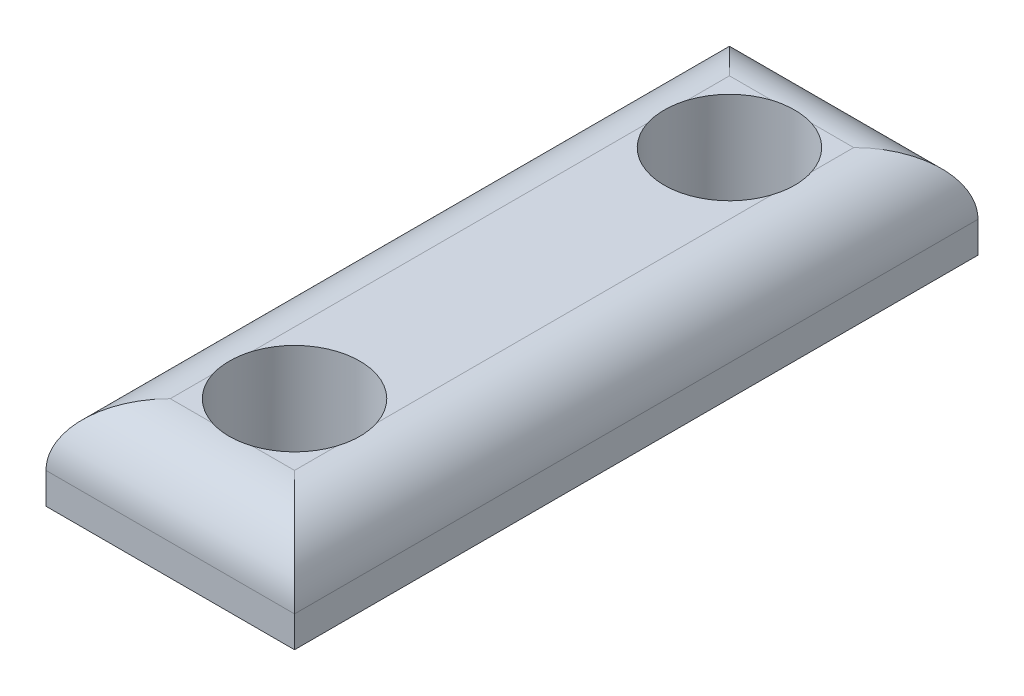
ISO-10303-21;
HEADER;
FILE_DESCRIPTION(('STEP AP214'),'2;1');
FILE_NAME('part.step','',(''),(''),'','','');
FILE_SCHEMA(('AUTOMOTIVE_DESIGN { 1 0 10303 214 1 1 1 1 }'));
ENDSEC;
DATA;
#1=APPLICATION_CONTEXT('core data for automotive mechanical design processes');
#2=APPLICATION_PROTOCOL_DEFINITION('international standard','automotive_design',2000,#1);
#3=PRODUCT_CONTEXT('',#1,'mechanical');
#4=PRODUCT('Part','Part','',(#3));
#5=PRODUCT_RELATED_PRODUCT_CATEGORY('part','',(#4));
#6=PRODUCT_DEFINITION_FORMATION('','',#4);
#7=PRODUCT_DEFINITION_CONTEXT('part definition',#1,'design');
#8=PRODUCT_DEFINITION('design','',#6,#7);
#9=PRODUCT_DEFINITION_SHAPE('','',#8);
#10=(LENGTH_UNIT() NAMED_UNIT(*) SI_UNIT(.MILLI.,.METRE.));
#11=(NAMED_UNIT(*) PLANE_ANGLE_UNIT() SI_UNIT($,.RADIAN.));
#12=(NAMED_UNIT(*) SI_UNIT($,.STERADIAN.) SOLID_ANGLE_UNIT());
#13=UNCERTAINTY_MEASURE_WITH_UNIT(LENGTH_MEASURE(1.E-05),#10,'distance_accuracy_value','');
#14=(GEOMETRIC_REPRESENTATION_CONTEXT(3) GLOBAL_UNCERTAINTY_ASSIGNED_CONTEXT((#13)) GLOBAL_UNIT_ASSIGNED_CONTEXT((#10,
#11,#12)) REPRESENTATION_CONTEXT('',''));
#15=CARTESIAN_POINT('',(0.,0.,0.));
#16=DIRECTION('',(0.,0.,1.));
#17=DIRECTION('',(1.,0.,0.));
#18=AXIS2_PLACEMENT_3D('',#15,#16,#17);
#19=CARTESIAN_POINT('',(0.,1.5,0.));
#20=DIRECTION('',(0.,-1.,0.));
#21=DIRECTION('',(0.,0.,-1.));
#22=AXIS2_PLACEMENT_3D('',#19,#20,#21);
#23=PLANE('',#22);
#24=CARTESIAN_POINT('',(2.,1.5,-2.));
#25=DIRECTION('',(0.,1.,0.));
#26=DIRECTION('',(0.,0.,1.));
#27=AXIS2_PLACEMENT_3D('',#24,#25,#26);
#28=CIRCLE('',#27,1.05);
#29=CARTESIAN_POINT('',(2.32015621187164,1.5,-1.));
#30=VERTEX_POINT('',#29);
#31=CARTESIAN_POINT('',(3.,1.5,-1.67984378812835));
#32=VERTEX_POINT('',#31);
#33=EDGE_CURVE('E307',#30,#32,#28,.T.);
#34=ORIENTED_EDGE('',*,*,#33,.F.);
#35=DIRECTION('',(1.,0.,0.));
#36=VECTOR('',#35,1.);
#37=CARTESIAN_POINT('',(0.,1.5,-1.));
#38=LINE('',#37,#36);
#39=CARTESIAN_POINT('',(3.,1.5,-1.));
#40=VERTEX_POINT('',#39);
#41=EDGE_CURVE('E211',#30,#40,#38,.T.);
#42=ORIENTED_EDGE('',*,*,#41,.T.);
#43=DIRECTION('',(0.,0.,-1.));
#44=VECTOR('',#43,1.);
#45=CARTESIAN_POINT('',(3.,1.5,0.));
#46=LINE('',#45,#44);
#47=EDGE_CURVE('E208',#40,#32,#46,.T.);
#48=ORIENTED_EDGE('',*,*,#47,.T.);
#49=EDGE_LOOP('',(#34,#42,#48));
#50=FACE_BOUND('',#49,.T.);
#51=ADVANCED_FACE('F45',(#50),#23,.F.);
#52=CARTESIAN_POINT('',(3.,1.5,-2.32015621187165));
#53=VERTEX_POINT('',#52);
#54=CARTESIAN_POINT('',(1.,1.5,-2.32015621187164));
#55=VERTEX_POINT('',#54);
#56=EDGE_CURVE('E306',#53,#55,#28,.T.);
#57=ORIENTED_EDGE('',*,*,#56,.F.);
#58=DIRECTION('',(0.,0.,-1.));
#59=VECTOR('',#58,1.);
#60=CARTESIAN_POINT('',(3.,1.5,0.));
#61=LINE('',#60,#59);
#62=CARTESIAN_POINT('',(3.,1.5,-8.67984378812836));
#63=VERTEX_POINT('',#62);
#64=EDGE_CURVE('E205',#53,#63,#61,.T.);
#65=ORIENTED_EDGE('',*,*,#64,.T.);
#66=CARTESIAN_POINT('',(2.,1.5,-9.));
#67=DIRECTION('',(0.,1.,0.));
#68=DIRECTION('',(0.,0.,1.));
#69=AXIS2_PLACEMENT_3D('',#66,#67,#68);
#70=CIRCLE('',#69,1.05);
#71=CARTESIAN_POINT('',(1.,1.5,-8.67984378812836));
#72=VERTEX_POINT('',#71);
#73=EDGE_CURVE('E315',#72,#63,#70,.T.);
#74=ORIENTED_EDGE('',*,*,#73,.F.);
#75=DIRECTION('',(0.,0.,1.));
#76=VECTOR('',#75,1.);
#77=CARTESIAN_POINT('',(1.,1.5,0.));
#78=LINE('',#77,#76);
#79=EDGE_CURVE('E190',#72,#55,#78,.T.);
#80=ORIENTED_EDGE('',*,*,#79,.T.);
#81=EDGE_LOOP('',(#57,#65,#74,#80));
#82=FACE_BOUND('',#81,.T.);
#83=ADVANCED_FACE('F350',(#82),#23,.F.);
#84=CARTESIAN_POINT('',(3.,1.5,-9.32015621187164));
#85=VERTEX_POINT('',#84);
#86=CARTESIAN_POINT('',(2.32015621187165,1.5,-10.));
#87=VERTEX_POINT('',#86);
#88=EDGE_CURVE('E166',#85,#87,#70,.T.);
#89=ORIENTED_EDGE('',*,*,#88,.F.);
#90=DIRECTION('',(0.,0.,-1.));
#91=VECTOR('',#90,1.);
#92=CARTESIAN_POINT('',(3.,1.5,0.));
#93=LINE('',#92,#91);
#94=CARTESIAN_POINT('',(3.,1.5,-10.));
#95=VERTEX_POINT('',#94);
#96=EDGE_CURVE('E202',#85,#95,#93,.T.);
#97=ORIENTED_EDGE('',*,*,#96,.T.);
#98=DIRECTION('',(-1.,0.,0.));
#99=VECTOR('',#98,1.);
#100=CARTESIAN_POINT('',(0.,1.5,-10.));
#101=LINE('',#100,#99);
#102=EDGE_CURVE('E199',#95,#87,#101,.T.);
#103=ORIENTED_EDGE('',*,*,#102,.T.);
#104=EDGE_LOOP('',(#89,#97,#103));
#105=FACE_BOUND('',#104,.T.);
#106=ADVANCED_FACE('F352',(#105),#23,.F.);
#107=CARTESIAN_POINT('',(1.67984378812835,1.5,-10.));
#108=VERTEX_POINT('',#107);
#109=CARTESIAN_POINT('',(1.,1.5,-9.32015621187164));
#110=VERTEX_POINT('',#109);
#111=EDGE_CURVE('E320',#108,#110,#70,.T.);
#112=ORIENTED_EDGE('',*,*,#111,.F.);
#113=DIRECTION('',(-1.,0.,0.));
#114=VECTOR('',#113,1.);
#115=CARTESIAN_POINT('',(0.,1.5,-10.));
#116=LINE('',#115,#114);
#117=CARTESIAN_POINT('',(1.,1.5,-10.));
#118=VERTEX_POINT('',#117);
#119=EDGE_CURVE('E196',#108,#118,#116,.T.);
#120=ORIENTED_EDGE('',*,*,#119,.T.);
#121=DIRECTION('',(0.,0.,1.));
#122=VECTOR('',#121,1.);
#123=CARTESIAN_POINT('',(1.,1.5,0.));
#124=LINE('',#123,#122);
#125=EDGE_CURVE('E193',#118,#110,#124,.T.);
#126=ORIENTED_EDGE('',*,*,#125,.T.);
#127=EDGE_LOOP('',(#112,#120,#126));
#128=FACE_BOUND('',#127,.T.);
#129=ADVANCED_FACE('F354',(#128),#23,.F.);
#130=CARTESIAN_POINT('',(0.,1.5,0.));
#131=DIRECTION('',(1.,0.,0.));
#132=DIRECTION('',(0.,0.,-1.));
#133=AXIS2_PLACEMENT_3D('',#130,#131,#132);
#134=PLANE('',#133);
#135=DIRECTION('',(0.,-1.,0.));
#136=VECTOR('',#135,1.);
#137=CARTESIAN_POINT('',(0.,1.5,0.));
#138=LINE('',#137,#136);
#139=CARTESIAN_POINT('',(0.,0.5,0.));
#140=VERTEX_POINT('',#139);
#141=CARTESIAN_POINT('',(0.,0.,0.));
#142=VERTEX_POINT('',#141);
#143=EDGE_CURVE('E136',#140,#142,#138,.T.);
#144=ORIENTED_EDGE('',*,*,#143,.F.);
#145=DIRECTION('',(0.,0.,1.));
#146=VECTOR('',#145,1.);
#147=CARTESIAN_POINT('',(0.,0.5,0.));
#148=LINE('',#147,#146);
#149=CARTESIAN_POINT('',(0.,0.5,-11.));
#150=VERTEX_POINT('',#149);
#151=EDGE_CURVE('E11',#140,#150,#148,.F.);
#152=ORIENTED_EDGE('',*,*,#151,.T.);
#153=DIRECTION('',(0.,-1.,0.));
#154=VECTOR('',#153,1.);
#155=CARTESIAN_POINT('',(0.,1.5,-11.));
#156=LINE('',#155,#154);
#157=CARTESIAN_POINT('',(0.,0.,-11.));
#158=VERTEX_POINT('',#157);
#159=EDGE_CURVE('E159',#150,#158,#156,.T.);
#160=ORIENTED_EDGE('',*,*,#159,.T.);
#161=DIRECTION('',(0.,0.,1.));
#162=VECTOR('',#161,1.);
#163=CARTESIAN_POINT('',(0.,0.,0.));
#164=LINE('',#163,#162);
#165=EDGE_CURVE('E153',#158,#142,#164,.T.);
#166=ORIENTED_EDGE('',*,*,#165,.T.);
#167=EDGE_LOOP('',(#144,#152,#160,#166));
#168=FACE_BOUND('',#167,.T.);
#169=ADVANCED_FACE('F158',(#168),#134,.F.);
#170=CARTESIAN_POINT('',(0.,1.5,0.));
#171=DIRECTION('',(0.,0.,-1.));
#172=DIRECTION('',(-1.,0.,0.));
#173=AXIS2_PLACEMENT_3D('',#170,#171,#172);
#174=PLANE('',#173);
#175=DIRECTION('',(0.,-1.,0.));
#176=VECTOR('',#175,1.);
#177=CARTESIAN_POINT('',(4.,1.5,0.));
#178=LINE('',#177,#176);
#179=CARTESIAN_POINT('',(4.,0.5,0.));
#180=VERTEX_POINT('',#179);
#181=CARTESIAN_POINT('',(4.,0.,0.));
#182=VERTEX_POINT('',#181);
#183=EDGE_CURVE('E147',#180,#182,#178,.T.);
#184=ORIENTED_EDGE('',*,*,#183,.F.);
#185=DIRECTION('',(1.,0.,0.));
#186=VECTOR('',#185,1.);
#187=CARTESIAN_POINT('',(0.,0.5,0.));
#188=LINE('',#187,#186);
#189=EDGE_CURVE('E143',#180,#140,#188,.F.);
#190=ORIENTED_EDGE('',*,*,#189,.T.);
#191=ORIENTED_EDGE('',*,*,#143,.T.);
#192=DIRECTION('',(1.,0.,0.));
#193=VECTOR('',#192,1.);
#194=CARTESIAN_POINT('',(0.,0.,0.));
#195=LINE('',#194,#193);
#196=EDGE_CURVE('E140',#142,#182,#195,.T.);
#197=ORIENTED_EDGE('',*,*,#196,.T.);
#198=EDGE_LOOP('',(#184,#190,#191,#197));
#199=FACE_BOUND('',#198,.T.);
#200=ADVANCED_FACE('F139',(#199),#174,.F.);
#201=CARTESIAN_POINT('',(4.,1.5,0.));
#202=DIRECTION('',(-1.,0.,0.));
#203=DIRECTION('',(0.,0.,1.));
#204=AXIS2_PLACEMENT_3D('',#201,#202,#203);
#205=PLANE('',#204);
#206=DIRECTION('',(0.,-1.,0.));
#207=VECTOR('',#206,1.);
#208=CARTESIAN_POINT('',(4.,1.5,-11.));
#209=LINE('',#208,#207);
#210=CARTESIAN_POINT('',(4.,0.5,-11.));
#211=VERTEX_POINT('',#210);
#212=CARTESIAN_POINT('',(4.,0.,-11.));
#213=VERTEX_POINT('',#212);
#214=EDGE_CURVE('E179',#211,#213,#209,.T.);
#215=ORIENTED_EDGE('',*,*,#214,.F.);
#216=DIRECTION('',(0.,0.,-1.));
#217=VECTOR('',#216,1.);
#218=CARTESIAN_POINT('',(4.,0.5,0.));
#219=LINE('',#218,#217);
#220=EDGE_CURVE('E272',#211,#180,#219,.F.);
#221=ORIENTED_EDGE('',*,*,#220,.T.);
#222=ORIENTED_EDGE('',*,*,#183,.T.);
#223=DIRECTION('',(0.,0.,-1.));
#224=VECTOR('',#223,1.);
#225=CARTESIAN_POINT('',(4.,0.,0.));
#226=LINE('',#225,#224);
#227=EDGE_CURVE('E155',#182,#213,#226,.T.);
#228=ORIENTED_EDGE('',*,*,#227,.T.);
#229=EDGE_LOOP('',(#215,#221,#222,#228));
#230=FACE_BOUND('',#229,.T.);
#231=ADVANCED_FACE('F372',(#230),#205,.F.);
#232=CARTESIAN_POINT('',(0.,1.5,-11.));
#233=DIRECTION('',(0.,0.,1.));
#234=DIRECTION('',(1.,0.,0.));
#235=AXIS2_PLACEMENT_3D('',#232,#233,#234);
#236=PLANE('',#235);
#237=ORIENTED_EDGE('',*,*,#159,.F.);
#238=DIRECTION('',(-1.,0.,0.));
#239=VECTOR('',#238,1.);
#240=CARTESIAN_POINT('',(0.,0.5,-11.));
#241=LINE('',#240,#239);
#242=EDGE_CURVE('E56',#150,#211,#241,.F.);
#243=ORIENTED_EDGE('',*,*,#242,.T.);
#244=ORIENTED_EDGE('',*,*,#214,.T.);
#245=DIRECTION('',(-1.,0.,0.));
#246=VECTOR('',#245,1.);
#247=CARTESIAN_POINT('',(0.,0.,-11.));
#248=LINE('',#247,#246);
#249=EDGE_CURVE('E174',#213,#158,#248,.T.);
#250=ORIENTED_EDGE('',*,*,#249,.T.);
#251=EDGE_LOOP('',(#237,#243,#244,#250));
#252=FACE_BOUND('',#251,.T.);
#253=ADVANCED_FACE('F366',(#252),#236,.F.);
#254=DIRECTION('',(0.,0.,1.));
#255=VECTOR('',#254,1.);
#256=CARTESIAN_POINT('',(1.,1.5,0.));
#257=LINE('',#256,#255);
#258=CARTESIAN_POINT('',(1.,1.5,-1.67984378812836));
#259=VERTEX_POINT('',#258);
#260=CARTESIAN_POINT('',(1.,1.5,-1.));
#261=VERTEX_POINT('',#260);
#262=EDGE_CURVE('E146',#259,#261,#257,.T.);
#263=ORIENTED_EDGE('',*,*,#262,.T.);
#264=DIRECTION('',(1.,0.,0.));
#265=VECTOR('',#264,1.);
#266=CARTESIAN_POINT('',(0.,1.5,-1.));
#267=LINE('',#266,#265);
#268=CARTESIAN_POINT('',(1.67984378812836,1.5,-1.));
#269=VERTEX_POINT('',#268);
#270=EDGE_CURVE('E186',#261,#269,#267,.T.);
#271=ORIENTED_EDGE('',*,*,#270,.T.);
#272=EDGE_CURVE('E301',#259,#269,#28,.T.);
#273=ORIENTED_EDGE('',*,*,#272,.F.);
#274=EDGE_LOOP('',(#263,#271,#273));
#275=FACE_BOUND('',#274,.T.);
#276=ADVANCED_FACE('F239',(#275),#23,.F.);
#277=CARTESIAN_POINT('',(0.,0.,0.));
#278=DIRECTION('',(0.,-1.,0.));
#279=DIRECTION('',(0.,0.,-1.));
#280=AXIS2_PLACEMENT_3D('',#277,#278,#279);
#281=PLANE('',#280);
#282=CARTESIAN_POINT('',(2.,0.,-9.));
#283=DIRECTION('',(0.,1.,0.));
#284=DIRECTION('',(0.,0.,1.));
#285=AXIS2_PLACEMENT_3D('',#282,#283,#284);
#286=CIRCLE('',#285,1.05);
#287=CARTESIAN_POINT('',(2.,0.,-7.95));
#288=VERTEX_POINT('',#287);
#289=EDGE_CURVE('E162',#288,#288,#286,.T.);
#290=ORIENTED_EDGE('',*,*,#289,.T.);
#291=EDGE_LOOP('',(#290));
#292=FACE_BOUND('',#291,.T.);
#293=CARTESIAN_POINT('',(2.,0.,-2.));
#294=DIRECTION('',(0.,1.,0.));
#295=DIRECTION('',(0.,0.,1.));
#296=AXIS2_PLACEMENT_3D('',#293,#294,#295);
#297=CIRCLE('',#296,1.05);
#298=CARTESIAN_POINT('',(2.,0.,-0.95));
#299=VERTEX_POINT('',#298);
#300=EDGE_CURVE('E169',#299,#299,#297,.T.);
#301=ORIENTED_EDGE('',*,*,#300,.T.);
#302=EDGE_LOOP('',(#301));
#303=FACE_BOUND('',#302,.T.);
#304=ORIENTED_EDGE('',*,*,#165,.F.);
#305=ORIENTED_EDGE('',*,*,#249,.F.);
#306=ORIENTED_EDGE('',*,*,#227,.F.);
#307=ORIENTED_EDGE('',*,*,#196,.F.);
#308=EDGE_LOOP('',(#304,#305,#306,#307));
#309=FACE_BOUND('',#308,.T.);
#310=ADVANCED_FACE('F151',(#292,#303,#309),#281,.T.);
#311=CARTESIAN_POINT('',(2.,0.,-2.));
#312=DIRECTION('',(0.,1.,0.));
#313=DIRECTION('',(0.,0.,1.));
#314=AXIS2_PLACEMENT_3D('',#311,#312,#313);
#315=CYLINDRICAL_SURFACE('',#314,1.05);
#316=ORIENTED_EDGE('',*,*,#300,.F.);
#317=EDGE_LOOP('',(#316));
#318=FACE_BOUND('',#317,.T.);
#319=ORIENTED_EDGE('',*,*,#272,.T.);
#320=CARTESIAN_POINT('',(1.67984378812836,1.5,-1.));
#321=CARTESIAN_POINT('',(1.7083146445285,1.49999078062786,-0.990881689680414));
#322=CARTESIAN_POINT('',(1.73717522062107,1.49987492021462,-0.982985544395835));
#323=CARTESIAN_POINT('',(1.79546567611279,1.49956488118688,-0.969680709385754));
#324=CARTESIAN_POINT('',(1.82489558932011,1.49937069790776,-0.964272167853579));
#325=CARTESIAN_POINT('',(1.88335894378148,1.49904322361336,-0.956092009440953));
#326=CARTESIAN_POINT('',(1.91238346250272,1.49890851093904,-0.953256891326788));
#327=CARTESIAN_POINT('',(1.97055582078959,1.49875071439344,-0.950008316603312));
#328=CARTESIAN_POINT('',(1.99970363763985,1.49872761078625,-0.949594431842813));
#329=CARTESIAN_POINT('',(2.07768297864805,1.49883830680776,-0.95174010182381));
#330=CARTESIAN_POINT('',(2.12647877189859,1.4990889409609,-0.956502783258088));
#331=CARTESIAN_POINT('',(2.19929805029389,1.49952012707086,-0.968783871996337));
#332=CARTESIAN_POINT('',(2.22377224478004,1.4996750566138,-0.973817536239824));
#333=CARTESIAN_POINT('',(2.27230343709319,1.49991350436784,-0.985616631052707));
#334=CARTESIAN_POINT('',(2.29636037768054,1.499997012856,-0.992382297246055));
#335=CARTESIAN_POINT('',(2.32015621187164,1.5,-1.));
#336=B_SPLINE_CURVE_WITH_KNOTS('',3,(#320,#321,#322,#323,#324,#325,#326,#327,#328,#329,#330,
#331,#332,#333,#334,#335),.UNSPECIFIED.,.F.,.F.,(4,2,2,2,2,2,2,4),(0.,0.0896563026382176,
0.179317945654889,0.266701700031937,0.354070001710347,0.500596848327749,0.575504960595752,
0.650423268887875),.UNSPECIFIED.);
#337=EDGE_CURVE('E243',#269,#30,#336,.T.);
#338=ORIENTED_EDGE('',*,*,#337,.T.);
#339=ORIENTED_EDGE('',*,*,#33,.T.);
#340=CARTESIAN_POINT('',(3.,1.5,-1.67984378812835));
#341=CARTESIAN_POINT('',(3.00911831031959,1.49999078062786,-1.7083146445285));
#342=CARTESIAN_POINT('',(3.01701445560417,1.49987492021462,-1.73717522062106));
#343=CARTESIAN_POINT('',(3.03031929061425,1.49956488118688,-1.79546567611279));
#344=CARTESIAN_POINT('',(3.03572783214642,1.49937069790776,-1.82489558932011));
#345=CARTESIAN_POINT('',(3.04390799055905,1.49904322361336,-1.88335894378147));
#346=CARTESIAN_POINT('',(3.04674310867321,1.49890851093904,-1.91238346250272));
#347=CARTESIAN_POINT('',(3.04999168339669,1.49875071439343,-1.97055582078958));
#348=CARTESIAN_POINT('',(3.05040556815719,1.49872761078625,-1.99970363763985));
#349=CARTESIAN_POINT('',(3.04825989817619,1.49883830680776,-2.07768297864805));
#350=CARTESIAN_POINT('',(3.04349721674191,1.4990889409609,-2.12647877189858));
#351=CARTESIAN_POINT('',(3.03121612800366,1.49952012707086,-2.19929805029389));
#352=CARTESIAN_POINT('',(3.02618246376018,1.4996750566138,-2.22377224478004));
#353=CARTESIAN_POINT('',(3.01438336894729,1.49991350436784,-2.27230343709319));
#354=CARTESIAN_POINT('',(3.00761770275395,1.499997012856,-2.29636037768054));
#355=CARTESIAN_POINT('',(3.,1.5,-2.32015621187165));
#356=B_SPLINE_CURVE_WITH_KNOTS('',3,(#340,#341,#342,#343,#344,#345,#346,#347,#348,#349,#350,
#351,#352,#353,#354,#355),.UNSPECIFIED.,.F.,.F.,(4,2,2,2,2,2,2,4),(0.,0.089656302638218,
0.179317945654889,0.266701700031937,0.354070001710347,0.500596848327753,0.575504960595758,
0.650423268887884),.UNSPECIFIED.);
#357=EDGE_CURVE('E222',#32,#53,#356,.T.);
#358=ORIENTED_EDGE('',*,*,#357,.T.);
#359=ORIENTED_EDGE('',*,*,#56,.T.);
#360=CARTESIAN_POINT('',(1.,1.5,-2.32015621187164));
#361=CARTESIAN_POINT('',(0.990881689680414,1.49999078062786,-2.29168535547149));
#362=CARTESIAN_POINT('',(0.982985544395836,1.49987492021462,-2.26282477937893));
#363=CARTESIAN_POINT('',(0.969680709385755,1.49956488118688,-2.2045343238872));
#364=CARTESIAN_POINT('',(0.96427216785358,1.49937069790776,-2.17510441067989));
#365=CARTESIAN_POINT('',(0.956092009440954,1.49904322361336,-2.11664105621852));
#366=CARTESIAN_POINT('',(0.953256891326789,1.49890851093904,-2.08761653749727));
#367=CARTESIAN_POINT('',(0.950008316603313,1.49875071439344,-2.02944417921041));
#368=CARTESIAN_POINT('',(0.949594431842814,1.49872761078625,-2.00029636236014));
#369=CARTESIAN_POINT('',(0.951740101823812,1.49883830680776,-1.92231702135195));
#370=CARTESIAN_POINT('',(0.956502783258089,1.4990889409609,-1.87352122810141));
#371=CARTESIAN_POINT('',(0.968783871996339,1.49952012707086,-1.80070194970611));
#372=CARTESIAN_POINT('',(0.973817536239825,1.4996750566138,-1.77622775521996));
#373=CARTESIAN_POINT('',(0.985616631052707,1.49991350436784,-1.72769656290682));
#374=CARTESIAN_POINT('',(0.992382297246055,1.499997012856,-1.70363962231947));
#375=CARTESIAN_POINT('',(1.,1.5,-1.67984378812836));
#376=B_SPLINE_CURVE_WITH_KNOTS('',3,(#360,#361,#362,#363,#364,#365,#366,#367,#368,#369,#370,
#371,#372,#373,#374,#375),.UNSPECIFIED.,.F.,.F.,(4,2,2,2,2,2,2,4),(0.,0.0896563026382177,
0.179317945654889,0.266701700031937,0.354070001710347,0.500596848327745,0.575504960595745,
0.650423268887866),.UNSPECIFIED.);
#377=EDGE_CURVE('E214',#55,#259,#376,.T.);
#378=ORIENTED_EDGE('',*,*,#377,.T.);
#379=EDGE_LOOP('',(#319,#338,#339,#358,#359,#378));
#380=FACE_BOUND('',#379,.T.);
#381=ADVANCED_FACE('F231',(#318,#380),#315,.F.);
#382=CARTESIAN_POINT('',(2.,0.,-9.));
#383=DIRECTION('',(0.,1.,0.));
#384=DIRECTION('',(0.,0.,1.));
#385=AXIS2_PLACEMENT_3D('',#382,#383,#384);
#386=CYLINDRICAL_SURFACE('',#385,1.05);
#387=ORIENTED_EDGE('',*,*,#289,.F.);
#388=EDGE_LOOP('',(#387));
#389=FACE_BOUND('',#388,.T.);
#390=ORIENTED_EDGE('',*,*,#73,.T.);
#391=CARTESIAN_POINT('',(3.,1.5,-8.67984378812836));
#392=CARTESIAN_POINT('',(3.00911831031959,1.49999078062786,-8.7083146445285));
#393=CARTESIAN_POINT('',(3.01701445560416,1.49987492021462,-8.73717522062106));
#394=CARTESIAN_POINT('',(3.03031929061425,1.49956488118688,-8.79546567611279));
#395=CARTESIAN_POINT('',(3.03572783214642,1.49937069790776,-8.82489558932011));
#396=CARTESIAN_POINT('',(3.04390799055905,1.49904322361336,-8.88335894378147));
#397=CARTESIAN_POINT('',(3.04674310867321,1.49890851093904,-8.91238346250272));
#398=CARTESIAN_POINT('',(3.04999168339669,1.49875071439343,-8.97055582078958));
#399=CARTESIAN_POINT('',(3.05040556815719,1.49872761078625,-8.99970363763985));
#400=CARTESIAN_POINT('',(3.04825989817619,1.49883830680776,-9.07768297864805));
#401=CARTESIAN_POINT('',(3.04349721674191,1.4990889409609,-9.12647877189858));
#402=CARTESIAN_POINT('',(3.03121612800366,1.49952012707086,-9.19929805029389));
#403=CARTESIAN_POINT('',(3.02618246376018,1.4996750566138,-9.22377224478004));
#404=CARTESIAN_POINT('',(3.01438336894729,1.49991350436784,-9.27230343709319));
#405=CARTESIAN_POINT('',(3.00761770275395,1.499997012856,-9.29636037768054));
#406=CARTESIAN_POINT('',(3.,1.5,-9.32015621187164));
#407=B_SPLINE_CURVE_WITH_KNOTS('',3,(#391,#392,#393,#394,#395,#396,#397,#398,#399,#400,#401,
#402,#403,#404,#405,#406),.UNSPECIFIED.,.F.,.F.,(4,2,2,2,2,2,2,4),(0.,0.0896563026382166,
0.179317945654889,0.266701700031938,0.354070001710347,0.500596848327753,0.575504960595755,
0.650423268887879),.UNSPECIFIED.);
#408=EDGE_CURVE('E264',#63,#85,#407,.T.);
#409=ORIENTED_EDGE('',*,*,#408,.T.);
#410=ORIENTED_EDGE('',*,*,#88,.T.);
#411=CARTESIAN_POINT('',(2.32015621187165,1.5,-10.));
#412=CARTESIAN_POINT('',(2.2916853554715,1.49999078062786,-10.0091183103196));
#413=CARTESIAN_POINT('',(2.26282477937894,1.49987492021462,-10.0170144556042));
#414=CARTESIAN_POINT('',(2.20453432388721,1.49956488118688,-10.0303192906142));
#415=CARTESIAN_POINT('',(2.17510441067989,1.49937069790776,-10.0357278321464));
#416=CARTESIAN_POINT('',(2.11664105621853,1.49904322361336,-10.043907990559));
#417=CARTESIAN_POINT('',(2.08761653749728,1.49890851093904,-10.0467431086732));
#418=CARTESIAN_POINT('',(2.02944417921042,1.49875071439343,-10.0499916833967));
#419=CARTESIAN_POINT('',(2.00029636236015,1.49872761078625,-10.0504055681572));
#420=CARTESIAN_POINT('',(1.92231702135195,1.49883830680776,-10.0482598981762));
#421=CARTESIAN_POINT('',(1.87352122810142,1.4990889409609,-10.0434972167419));
#422=CARTESIAN_POINT('',(1.80070194970611,1.49952012707086,-10.0312161280037));
#423=CARTESIAN_POINT('',(1.77622775521996,1.4996750566138,-10.0261824637602));
#424=CARTESIAN_POINT('',(1.72769656290681,1.49991350436784,-10.0143833689473));
#425=CARTESIAN_POINT('',(1.70363962231946,1.499997012856,-10.0076177027539));
#426=CARTESIAN_POINT('',(1.67984378812835,1.5,-10.));
#427=B_SPLINE_CURVE_WITH_KNOTS('',3,(#411,#412,#413,#414,#415,#416,#417,#418,#419,#420,#421,
#422,#423,#424,#425,#426),.UNSPECIFIED.,.F.,.F.,(4,2,2,2,2,2,2,4),(0.,0.0896563026382177,
0.179317945654889,0.266701700031937,0.354070001710348,0.500596848327753,0.575504960595757,
0.650423268887883),.UNSPECIFIED.);
#428=EDGE_CURVE('E273',#87,#108,#427,.T.);
#429=ORIENTED_EDGE('',*,*,#428,.T.);
#430=ORIENTED_EDGE('',*,*,#111,.T.);
#431=CARTESIAN_POINT('',(1.,1.5,-9.32015621187164));
#432=CARTESIAN_POINT('',(0.990881689680414,1.49999078062786,-9.2916853554715));
#433=CARTESIAN_POINT('',(0.982985544395836,1.49987492021462,-9.26282477937893));
#434=CARTESIAN_POINT('',(0.969680709385754,1.49956488118688,-9.20453432388721));
#435=CARTESIAN_POINT('',(0.964272167853579,1.49937069790776,-9.17510441067989));
#436=CARTESIAN_POINT('',(0.956092009440954,1.49904322361336,-9.11664105621852));
#437=CARTESIAN_POINT('',(0.953256891326789,1.49890851093904,-9.08761653749728));
#438=CARTESIAN_POINT('',(0.950008316603313,1.49875071439344,-9.02944417921041));
#439=CARTESIAN_POINT('',(0.949594431842813,1.49872761078625,-9.00029636236015));
#440=CARTESIAN_POINT('',(0.95174010182381,1.49883830680776,-8.92231702135195));
#441=CARTESIAN_POINT('',(0.956502783258088,1.4990889409609,-8.87352122810141));
#442=CARTESIAN_POINT('',(0.968783871996338,1.49952012707086,-8.80070194970611));
#443=CARTESIAN_POINT('',(0.973817536239824,1.4996750566138,-8.77622775521995));
#444=CARTESIAN_POINT('',(0.985616631052707,1.49991350436784,-8.72769656290681));
#445=CARTESIAN_POINT('',(0.992382297246055,1.499997012856,-8.70363962231946));
#446=CARTESIAN_POINT('',(1.,1.5,-8.67984378812836));
#447=B_SPLINE_CURVE_WITH_KNOTS('',3,(#431,#432,#433,#434,#435,#436,#437,#438,#439,#440,#441,
#442,#443,#444,#445,#446),.UNSPECIFIED.,.F.,.F.,(4,2,2,2,2,2,2,4),(0.,0.0896563026382182,
0.179317945654889,0.266701700031936,0.354070001710347,0.500596848327751,0.575504960595753,
0.650423268887875),.UNSPECIFIED.);
#448=EDGE_CURVE('E336',#110,#72,#447,.T.);
#449=ORIENTED_EDGE('',*,*,#448,.T.);
#450=EDGE_LOOP('',(#390,#409,#410,#429,#430,#449));
#451=FACE_BOUND('',#450,.T.);
#452=ADVANCED_FACE('F236',(#389,#451),#386,.F.);
#453=CARTESIAN_POINT('',(0.,0.5,-10.));
#454=DIRECTION('',(-1.,0.,0.));
#455=DIRECTION('',(0.,0.,1.));
#456=AXIS2_PLACEMENT_3D('',#453,#454,#455);
#457=CYLINDRICAL_SURFACE('',#456,1.);
#458=CARTESIAN_POINT('',(3.,0.5,-10.));
#459=DIRECTION('',(-0.707106781186547,0.,-0.707106781186547));
#460=DIRECTION('',(-0.707106781186547,0.,0.707106781186547));
#461=AXIS2_PLACEMENT_3D('',#458,#459,#460);
#462=ELLIPSE('',#461,1.41421356237309,1.);
#463=EDGE_CURVE('E288',#211,#95,#462,.F.);
#464=ORIENTED_EDGE('',*,*,#463,.F.);
#465=ORIENTED_EDGE('',*,*,#242,.F.);
#466=CARTESIAN_POINT('',(1.,0.5,-10.));
#467=DIRECTION('',(-0.707106781186547,0.,0.707106781186547));
#468=DIRECTION('',(0.707106781186547,0.,0.707106781186547));
#469=AXIS2_PLACEMENT_3D('',#466,#467,#468);
#470=ELLIPSE('',#469,1.41421356237309,1.);
#471=EDGE_CURVE('E50',#118,#150,#470,.T.);
#472=ORIENTED_EDGE('',*,*,#471,.F.);
#473=ORIENTED_EDGE('',*,*,#119,.F.);
#474=ORIENTED_EDGE('',*,*,#428,.F.);
#475=ORIENTED_EDGE('',*,*,#102,.F.);
#476=EDGE_LOOP('',(#464,#465,#472,#473,#474,#475));
#477=FACE_BOUND('',#476,.T.);
#478=ADVANCED_FACE('F47',(#477),#457,.T.);
#479=CARTESIAN_POINT('',(1.,0.5,0.));
#480=DIRECTION('',(0.,0.,1.));
#481=DIRECTION('',(1.,0.,0.));
#482=AXIS2_PLACEMENT_3D('',#479,#480,#481);
#483=CYLINDRICAL_SURFACE('',#482,1.);
#484=ORIENTED_EDGE('',*,*,#471,.T.);
#485=ORIENTED_EDGE('',*,*,#151,.F.);
#486=CARTESIAN_POINT('',(1.,0.5,-1.));
#487=DIRECTION('',(0.707106781186547,0.,0.707106781186547));
#488=DIRECTION('',(-0.707106781186547,0.,0.707106781186547));
#489=AXIS2_PLACEMENT_3D('',#486,#487,#488);
#490=ELLIPSE('',#489,1.41421356237309,1.);
#491=EDGE_CURVE('E286',#261,#140,#490,.T.);
#492=ORIENTED_EDGE('',*,*,#491,.F.);
#493=ORIENTED_EDGE('',*,*,#262,.F.);
#494=ORIENTED_EDGE('',*,*,#377,.F.);
#495=ORIENTED_EDGE('',*,*,#79,.F.);
#496=ORIENTED_EDGE('',*,*,#448,.F.);
#497=ORIENTED_EDGE('',*,*,#125,.F.);
#498=EDGE_LOOP('',(#484,#485,#492,#493,#494,#495,#496,#497));
#499=FACE_BOUND('',#498,.T.);
#500=ADVANCED_FACE('F229',(#499),#483,.T.);
#501=CARTESIAN_POINT('',(3.,0.5,0.));
#502=DIRECTION('',(0.,0.,-1.));
#503=DIRECTION('',(-1.,0.,0.));
#504=AXIS2_PLACEMENT_3D('',#501,#502,#503);
#505=CYLINDRICAL_SURFACE('',#504,1.);
#506=ORIENTED_EDGE('',*,*,#357,.F.);
#507=ORIENTED_EDGE('',*,*,#47,.F.);
#508=CARTESIAN_POINT('',(3.,0.5,-1.));
#509=DIRECTION('',(0.707106781186547,0.,-0.707106781186547));
#510=DIRECTION('',(-0.707106781186547,0.,-0.707106781186547));
#511=AXIS2_PLACEMENT_3D('',#508,#509,#510);
#512=ELLIPSE('',#511,1.41421356237309,1.);
#513=EDGE_CURVE('E282',#180,#40,#512,.F.);
#514=ORIENTED_EDGE('',*,*,#513,.F.);
#515=ORIENTED_EDGE('',*,*,#220,.F.);
#516=ORIENTED_EDGE('',*,*,#463,.T.);
#517=ORIENTED_EDGE('',*,*,#96,.F.);
#518=ORIENTED_EDGE('',*,*,#408,.F.);
#519=ORIENTED_EDGE('',*,*,#64,.F.);
#520=EDGE_LOOP('',(#506,#507,#514,#515,#516,#517,#518,#519));
#521=FACE_BOUND('',#520,.T.);
#522=ADVANCED_FACE('F256',(#521),#505,.T.);
#523=CARTESIAN_POINT('',(0.,0.5,-1.));
#524=DIRECTION('',(1.,0.,0.));
#525=DIRECTION('',(0.,0.,-1.));
#526=AXIS2_PLACEMENT_3D('',#523,#524,#525);
#527=CYLINDRICAL_SURFACE('',#526,1.);
#528=ORIENTED_EDGE('',*,*,#491,.T.);
#529=ORIENTED_EDGE('',*,*,#189,.F.);
#530=ORIENTED_EDGE('',*,*,#513,.T.);
#531=ORIENTED_EDGE('',*,*,#41,.F.);
#532=ORIENTED_EDGE('',*,*,#337,.F.);
#533=ORIENTED_EDGE('',*,*,#270,.F.);
#534=EDGE_LOOP('',(#528,#529,#530,#531,#532,#533));
#535=FACE_BOUND('',#534,.T.);
#536=ADVANCED_FACE('F252',(#535),#527,.T.);
#537=CLOSED_SHELL('',(#51,#83,#106,#129,#169,#200,#231,#253,#276,#310,#381,#452,#478,#500,#522,#536));
#538=MANIFOLD_SOLID_BREP('B2',#537);
#539=ADVANCED_BREP_SHAPE_REPRESENTATION('',(#18,#538),#14);
#540=SHAPE_DEFINITION_REPRESENTATION(#9,#539);
ENDSEC;
END-ISO-10303-21;
